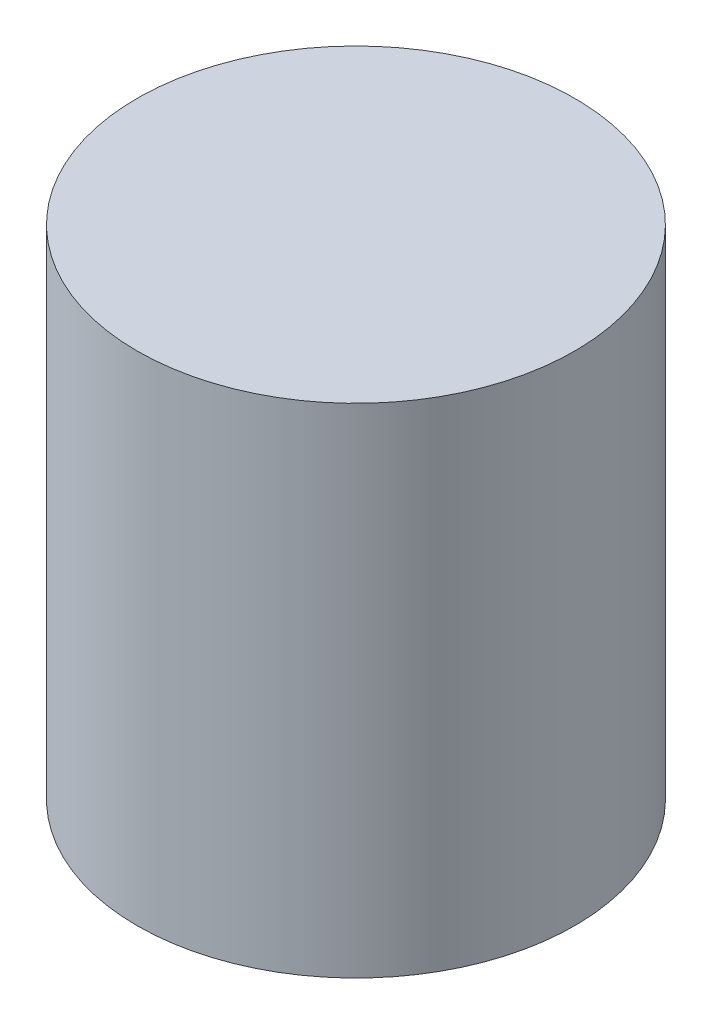
ISO-10303-21;
HEADER;
FILE_DESCRIPTION(('STEP AP214'),'2;1');
FILE_NAME('part.step','',(''),(''),'','','');
FILE_SCHEMA(('AUTOMOTIVE_DESIGN { 1 0 10303 214 1 1 1 1 }'));
ENDSEC;
DATA;
#1=APPLICATION_CONTEXT('core data for automotive mechanical design processes');
#2=APPLICATION_PROTOCOL_DEFINITION('international standard','automotive_design',2000,#1);
#3=PRODUCT_CONTEXT('',#1,'mechanical');
#4=PRODUCT('Part','Part','',(#3));
#5=PRODUCT_RELATED_PRODUCT_CATEGORY('part','',(#4));
#6=PRODUCT_DEFINITION_FORMATION('','',#4);
#7=PRODUCT_DEFINITION_CONTEXT('part definition',#1,'design');
#8=PRODUCT_DEFINITION('design','',#6,#7);
#9=PRODUCT_DEFINITION_SHAPE('','',#8);
#10=(LENGTH_UNIT() NAMED_UNIT(*) SI_UNIT(.MILLI.,.METRE.));
#11=(NAMED_UNIT(*) PLANE_ANGLE_UNIT() SI_UNIT($,.RADIAN.));
#12=(NAMED_UNIT(*) SI_UNIT($,.STERADIAN.) SOLID_ANGLE_UNIT());
#13=UNCERTAINTY_MEASURE_WITH_UNIT(LENGTH_MEASURE(1.E-05),#10,'distance_accuracy_value','');
#14=(GEOMETRIC_REPRESENTATION_CONTEXT(3) GLOBAL_UNCERTAINTY_ASSIGNED_CONTEXT((#13)) GLOBAL_UNIT_ASSIGNED_CONTEXT((#10,
#11,#12)) REPRESENTATION_CONTEXT('',''));
#15=CARTESIAN_POINT('',(0.,0.,0.));
#16=DIRECTION('',(0.,0.,1.));
#17=DIRECTION('',(1.,0.,0.));
#18=AXIS2_PLACEMENT_3D('',#15,#16,#17);
#19=CARTESIAN_POINT('',(0.,58.,0.));
#20=DIRECTION('',(0.,-1.,0.));
#21=DIRECTION('',(0.,0.,-1.));
#22=AXIS2_PLACEMENT_3D('',#19,#20,#21);
#23=CYLINDRICAL_SURFACE('',#22,25.5);
#24=CARTESIAN_POINT('',(0.,58.,0.));
#25=DIRECTION('',(0.,1.,0.));
#26=DIRECTION('',(0.,0.,1.));
#27=AXIS2_PLACEMENT_3D('',#24,#25,#26);
#28=CIRCLE('',#27,25.5);
#29=CARTESIAN_POINT('',(0.,58.,25.5));
#30=VERTEX_POINT('',#29);
#31=EDGE_CURVE('E10',#30,#30,#28,.T.);
#32=ORIENTED_EDGE('',*,*,#31,.F.);
#33=EDGE_LOOP('',(#32));
#34=FACE_BOUND('',#33,.T.);
#35=CARTESIAN_POINT('',(0.,0.,0.));
#36=DIRECTION('',(0.,1.,0.));
#37=DIRECTION('',(0.,0.,1.));
#38=AXIS2_PLACEMENT_3D('',#35,#36,#37);
#39=CIRCLE('',#38,25.5);
#40=CARTESIAN_POINT('',(0.,0.,25.5));
#41=VERTEX_POINT('',#40);
#42=EDGE_CURVE('E35',#41,#41,#39,.T.);
#43=ORIENTED_EDGE('',*,*,#42,.T.);
#44=EDGE_LOOP('',(#43));
#45=FACE_BOUND('',#44,.T.);
#46=ADVANCED_FACE('F32',(#34,#45),#23,.T.);
#47=CARTESIAN_POINT('',(0.,58.,0.));
#48=DIRECTION('',(0.,1.,0.));
#49=DIRECTION('',(0.,0.,1.));
#50=AXIS2_PLACEMENT_3D('',#47,#48,#49);
#51=PLANE('',#50);
#52=ORIENTED_EDGE('',*,*,#31,.T.);
#53=EDGE_LOOP('',(#52));
#54=FACE_BOUND('',#53,.T.);
#55=ADVANCED_FACE('F61',(#54),#51,.T.);
#56=CARTESIAN_POINT('',(0.,0.,0.));
#57=DIRECTION('',(0.,1.,0.));
#58=DIRECTION('',(0.,0.,1.));
#59=AXIS2_PLACEMENT_3D('',#56,#57,#58);
#60=PLANE('',#59);
#61=CARTESIAN_POINT('',(0.,0.,0.));
#62=DIRECTION('',(0.,-1.,0.));
#63=DIRECTION('',(0.,0.,-1.));
#64=AXIS2_PLACEMENT_3D('',#61,#62,#63);
#65=CIRCLE('',#64,22.5);
#66=CARTESIAN_POINT('',(0.,0.,-22.5));
#67=VERTEX_POINT('',#66);
#68=EDGE_CURVE('E44',#67,#67,#65,.T.);
#69=ORIENTED_EDGE('',*,*,#68,.F.);
#70=EDGE_LOOP('',(#69));
#71=FACE_BOUND('',#70,.T.);
#72=ORIENTED_EDGE('',*,*,#42,.F.);
#73=EDGE_LOOP('',(#72));
#74=FACE_BOUND('',#73,.T.);
#75=ADVANCED_FACE('F55',(#71,#74),#60,.F.);
#76=CARTESIAN_POINT('',(0.,55.,0.));
#77=DIRECTION('',(0.,-1.,0.));
#78=DIRECTION('',(0.,0.,-1.));
#79=AXIS2_PLACEMENT_3D('',#76,#77,#78);
#80=CYLINDRICAL_SURFACE('',#79,22.5);
#81=CARTESIAN_POINT('',(0.,55.,0.));
#82=DIRECTION('',(0.,-1.,0.));
#83=DIRECTION('',(0.,0.,-1.));
#84=AXIS2_PLACEMENT_3D('',#81,#82,#83);
#85=CIRCLE('',#84,22.5);
#86=CARTESIAN_POINT('',(0.,55.,-22.5));
#87=VERTEX_POINT('',#86);
#88=EDGE_CURVE('E42',#87,#87,#85,.T.);
#89=ORIENTED_EDGE('',*,*,#88,.F.);
#90=EDGE_LOOP('',(#89));
#91=FACE_BOUND('',#90,.T.);
#92=ORIENTED_EDGE('',*,*,#68,.T.);
#93=EDGE_LOOP('',(#92));
#94=FACE_BOUND('',#93,.T.);
#95=ADVANCED_FACE('F52',(#91,#94),#80,.F.);
#96=CARTESIAN_POINT('',(0.,55.,0.));
#97=DIRECTION('',(0.,-1.,0.));
#98=DIRECTION('',(0.,0.,-1.));
#99=AXIS2_PLACEMENT_3D('',#96,#97,#98);
#100=PLANE('',#99);
#101=ORIENTED_EDGE('',*,*,#88,.T.);
#102=EDGE_LOOP('',(#101));
#103=FACE_BOUND('',#102,.T.);
#104=ADVANCED_FACE('F50',(#103),#100,.T.);
#105=CLOSED_SHELL('',(#46,#55,#75,#95,#104));
#106=MANIFOLD_SOLID_BREP('B2',#105);
#107=ADVANCED_BREP_SHAPE_REPRESENTATION('',(#18,#106),#14);
#108=SHAPE_DEFINITION_REPRESENTATION(#9,#107);
ENDSEC;
END-ISO-10303-21;
